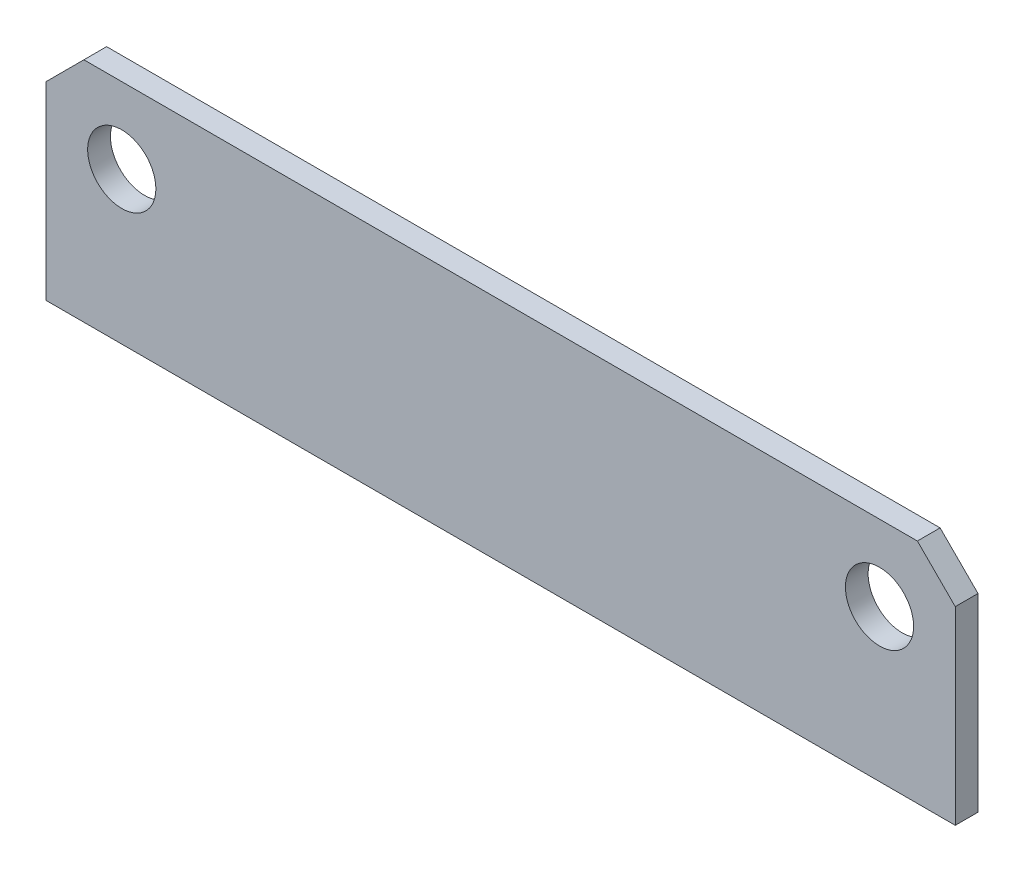
ISO-10303-21;
HEADER;
FILE_DESCRIPTION(('STEP AP214'),'2;1');
FILE_NAME('part.step','',(''),(''),'','','');
FILE_SCHEMA(('AUTOMOTIVE_DESIGN { 1 0 10303 214 1 1 1 1 }'));
ENDSEC;
DATA;
#1=APPLICATION_CONTEXT('core data for automotive mechanical design processes');
#2=APPLICATION_PROTOCOL_DEFINITION('international standard','automotive_design',2000,#1);
#3=PRODUCT_CONTEXT('',#1,'mechanical');
#4=PRODUCT('Part','Part','',(#3));
#5=PRODUCT_RELATED_PRODUCT_CATEGORY('part','',(#4));
#6=PRODUCT_DEFINITION_FORMATION('','',#4);
#7=PRODUCT_DEFINITION_CONTEXT('part definition',#1,'design');
#8=PRODUCT_DEFINITION('design','',#6,#7);
#9=PRODUCT_DEFINITION_SHAPE('','',#8);
#10=(LENGTH_UNIT() NAMED_UNIT(*) SI_UNIT(.MILLI.,.METRE.));
#11=(NAMED_UNIT(*) PLANE_ANGLE_UNIT() SI_UNIT($,.RADIAN.));
#12=(NAMED_UNIT(*) SI_UNIT($,.STERADIAN.) SOLID_ANGLE_UNIT());
#13=UNCERTAINTY_MEASURE_WITH_UNIT(LENGTH_MEASURE(1.E-05),#10,'distance_accuracy_value','');
#14=(GEOMETRIC_REPRESENTATION_CONTEXT(3) GLOBAL_UNCERTAINTY_ASSIGNED_CONTEXT((#13)) GLOBAL_UNIT_ASSIGNED_CONTEXT((#10,
#11,#12)) REPRESENTATION_CONTEXT('',''));
#15=CARTESIAN_POINT('',(0.,0.,0.));
#16=DIRECTION('',(0.,0.,1.));
#17=DIRECTION('',(1.,0.,0.));
#18=AXIS2_PLACEMENT_3D('',#15,#16,#17);
#19=CARTESIAN_POINT('',(0.,0.,3.));
#20=DIRECTION('',(0.,0.,1.));
#21=DIRECTION('',(1.,0.,0.));
#22=AXIS2_PLACEMENT_3D('',#19,#20,#21);
#23=PLANE('',#22);
#24=CARTESIAN_POINT('',(-50.,20.,3.));
#25=DIRECTION('',(0.,0.,1.));
#26=DIRECTION('',(1.,0.,0.));
#27=AXIS2_PLACEMENT_3D('',#24,#25,#26);
#28=CIRCLE('',#27,4.5);
#29=CARTESIAN_POINT('',(-45.5,20.,3.));
#30=VERTEX_POINT('',#29);
#31=EDGE_CURVE('E122',#30,#30,#28,.T.);
#32=ORIENTED_EDGE('',*,*,#31,.F.);
#33=EDGE_LOOP('',(#32));
#34=FACE_BOUND('',#33,.T.);
#35=DIRECTION('',(0.,1.,0.));
#36=VECTOR('',#35,1.);
#37=CARTESIAN_POINT('',(60.,25.,3.));
#38=LINE('',#37,#36);
#39=CARTESIAN_POINT('',(60.,0.,3.));
#40=VERTEX_POINT('',#39);
#41=CARTESIAN_POINT('',(60.,25.,3.));
#42=VERTEX_POINT('',#41);
#43=EDGE_CURVE('E129',#40,#42,#38,.T.);
#44=ORIENTED_EDGE('',*,*,#43,.T.);
#45=DIRECTION('',(-0.707106781186547,0.707106781186548,0.));
#46=VECTOR('',#45,1.);
#47=CARTESIAN_POINT('',(55.,30.,3.));
#48=LINE('',#47,#46);
#49=CARTESIAN_POINT('',(55.,30.,3.));
#50=VERTEX_POINT('',#49);
#51=EDGE_CURVE('E87',#42,#50,#48,.T.);
#52=ORIENTED_EDGE('',*,*,#51,.T.);
#53=DIRECTION('',(-1.,0.,0.));
#54=VECTOR('',#53,1.);
#55=CARTESIAN_POINT('',(-55.,30.,3.));
#56=LINE('',#55,#54);
#57=CARTESIAN_POINT('',(-55.,30.,3.));
#58=VERTEX_POINT('',#57);
#59=EDGE_CURVE('E100',#50,#58,#56,.T.);
#60=ORIENTED_EDGE('',*,*,#59,.T.);
#61=DIRECTION('',(-0.707106781186547,-0.707106781186548,0.));
#62=VECTOR('',#61,1.);
#63=CARTESIAN_POINT('',(-60.,25.,3.));
#64=LINE('',#63,#62);
#65=CARTESIAN_POINT('',(-60.,25.,3.));
#66=VERTEX_POINT('',#65);
#67=EDGE_CURVE('E94',#58,#66,#64,.T.);
#68=ORIENTED_EDGE('',*,*,#67,.T.);
#69=DIRECTION('',(0.,-1.,0.));
#70=VECTOR('',#69,1.);
#71=CARTESIAN_POINT('',(-60.,25.,3.));
#72=LINE('',#71,#70);
#73=CARTESIAN_POINT('',(-60.,0.,3.));
#74=VERTEX_POINT('',#73);
#75=EDGE_CURVE('E98',#66,#74,#72,.T.);
#76=ORIENTED_EDGE('',*,*,#75,.T.);
#77=DIRECTION('',(1.,0.,0.));
#78=VECTOR('',#77,1.);
#79=CARTESIAN_POINT('',(-60.,0.,3.));
#80=LINE('',#79,#78);
#81=EDGE_CURVE('E50',#74,#40,#80,.T.);
#82=ORIENTED_EDGE('',*,*,#81,.T.);
#83=EDGE_LOOP('',(#44,#52,#60,#68,#76,#82));
#84=FACE_BOUND('',#83,.T.);
#85=CARTESIAN_POINT('',(50.,20.,3.));
#86=DIRECTION('',(0.,0.,1.));
#87=DIRECTION('',(1.,0.,0.));
#88=AXIS2_PLACEMENT_3D('',#85,#86,#87);
#89=CIRCLE('',#88,4.5);
#90=CARTESIAN_POINT('',(54.5,20.,3.));
#91=VERTEX_POINT('',#90);
#92=EDGE_CURVE('E171',#91,#91,#89,.T.);
#93=ORIENTED_EDGE('',*,*,#92,.F.);
#94=EDGE_LOOP('',(#93));
#95=FACE_BOUND('',#94,.T.);
#96=ADVANCED_FACE('F33',(#34,#84,#95),#23,.T.);
#97=CARTESIAN_POINT('',(0.,0.,0.));
#98=DIRECTION('',(0.,0.,1.));
#99=DIRECTION('',(1.,0.,0.));
#100=AXIS2_PLACEMENT_3D('',#97,#98,#99);
#101=PLANE('',#100);
#102=DIRECTION('',(0.,1.,0.));
#103=VECTOR('',#102,1.);
#104=CARTESIAN_POINT('',(60.,25.,0.));
#105=LINE('',#104,#103);
#106=CARTESIAN_POINT('',(60.,0.,0.));
#107=VERTEX_POINT('',#106);
#108=CARTESIAN_POINT('',(60.,25.,0.));
#109=VERTEX_POINT('',#108);
#110=EDGE_CURVE('E118',#107,#109,#105,.T.);
#111=ORIENTED_EDGE('',*,*,#110,.F.);
#112=DIRECTION('',(1.,0.,0.));
#113=VECTOR('',#112,1.);
#114=CARTESIAN_POINT('',(-60.,0.,0.));
#115=LINE('',#114,#113);
#116=CARTESIAN_POINT('',(-60.,0.,0.));
#117=VERTEX_POINT('',#116);
#118=EDGE_CURVE('E79',#117,#107,#115,.T.);
#119=ORIENTED_EDGE('',*,*,#118,.F.);
#120=DIRECTION('',(0.,-1.,0.));
#121=VECTOR('',#120,1.);
#122=CARTESIAN_POINT('',(-60.,25.,0.));
#123=LINE('',#122,#121);
#124=CARTESIAN_POINT('',(-60.,25.,0.));
#125=VERTEX_POINT('',#124);
#126=EDGE_CURVE('E73',#125,#117,#123,.T.);
#127=ORIENTED_EDGE('',*,*,#126,.F.);
#128=DIRECTION('',(-0.707106781186547,-0.707106781186548,0.));
#129=VECTOR('',#128,1.);
#130=CARTESIAN_POINT('',(-60.,25.,0.));
#131=LINE('',#130,#129);
#132=CARTESIAN_POINT('',(-55.,30.,0.));
#133=VERTEX_POINT('',#132);
#134=EDGE_CURVE('E108',#133,#125,#131,.T.);
#135=ORIENTED_EDGE('',*,*,#134,.F.);
#136=DIRECTION('',(-1.,0.,0.));
#137=VECTOR('',#136,1.);
#138=CARTESIAN_POINT('',(-55.,30.,0.));
#139=LINE('',#138,#137);
#140=CARTESIAN_POINT('',(55.,30.,0.));
#141=VERTEX_POINT('',#140);
#142=EDGE_CURVE('E124',#141,#133,#139,.T.);
#143=ORIENTED_EDGE('',*,*,#142,.F.);
#144=DIRECTION('',(-0.707106781186547,0.707106781186548,0.));
#145=VECTOR('',#144,1.);
#146=CARTESIAN_POINT('',(55.,30.,0.));
#147=LINE('',#146,#145);
#148=EDGE_CURVE('E121',#109,#141,#147,.T.);
#149=ORIENTED_EDGE('',*,*,#148,.F.);
#150=EDGE_LOOP('',(#111,#119,#127,#135,#143,#149));
#151=FACE_BOUND('',#150,.T.);
#152=CARTESIAN_POINT('',(-50.,20.,0.));
#153=DIRECTION('',(0.,0.,1.));
#154=DIRECTION('',(1.,0.,0.));
#155=AXIS2_PLACEMENT_3D('',#152,#153,#154);
#156=CIRCLE('',#155,4.5);
#157=CARTESIAN_POINT('',(-45.5,20.,0.));
#158=VERTEX_POINT('',#157);
#159=EDGE_CURVE('E177',#158,#158,#156,.T.);
#160=ORIENTED_EDGE('',*,*,#159,.T.);
#161=EDGE_LOOP('',(#160));
#162=FACE_BOUND('',#161,.T.);
#163=CARTESIAN_POINT('',(50.,20.,0.));
#164=DIRECTION('',(0.,0.,1.));
#165=DIRECTION('',(1.,0.,0.));
#166=AXIS2_PLACEMENT_3D('',#163,#164,#165);
#167=CIRCLE('',#166,4.5);
#168=CARTESIAN_POINT('',(54.5,20.,0.));
#169=VERTEX_POINT('',#168);
#170=EDGE_CURVE('E174',#169,#169,#167,.T.);
#171=ORIENTED_EDGE('',*,*,#170,.T.);
#172=EDGE_LOOP('',(#171));
#173=FACE_BOUND('',#172,.T.);
#174=ADVANCED_FACE('F138',(#151,#162,#173),#101,.F.);
#175=CARTESIAN_POINT('',(60.,25.,3.));
#176=DIRECTION('',(-1.,0.,0.));
#177=DIRECTION('',(0.,-1.,0.));
#178=AXIS2_PLACEMENT_3D('',#175,#176,#177);
#179=PLANE('',#178);
#180=ORIENTED_EDGE('',*,*,#110,.T.);
#181=DIRECTION('',(0.,0.,-1.));
#182=VECTOR('',#181,1.);
#183=CARTESIAN_POINT('',(60.,25.,3.));
#184=LINE('',#183,#182);
#185=EDGE_CURVE('E11',#42,#109,#184,.T.);
#186=ORIENTED_EDGE('',*,*,#185,.F.);
#187=ORIENTED_EDGE('',*,*,#43,.F.);
#188=DIRECTION('',(0.,0.,-1.));
#189=VECTOR('',#188,1.);
#190=CARTESIAN_POINT('',(60.,0.,3.));
#191=LINE('',#190,#189);
#192=EDGE_CURVE('E114',#40,#107,#191,.T.);
#193=ORIENTED_EDGE('',*,*,#192,.T.);
#194=EDGE_LOOP('',(#180,#186,#187,#193));
#195=FACE_BOUND('',#194,.T.);
#196=ADVANCED_FACE('F35',(#195),#179,.F.);
#197=CARTESIAN_POINT('',(55.,30.,3.));
#198=DIRECTION('',(-0.707106781186548,-0.707106781186547,0.));
#199=DIRECTION('',(0.707106781186547,-0.707106781186548,0.));
#200=AXIS2_PLACEMENT_3D('',#197,#198,#199);
#201=PLANE('',#200);
#202=ORIENTED_EDGE('',*,*,#148,.T.);
#203=DIRECTION('',(0.,0.,-1.));
#204=VECTOR('',#203,1.);
#205=CARTESIAN_POINT('',(55.,30.,3.));
#206=LINE('',#205,#204);
#207=EDGE_CURVE('E42',#50,#141,#206,.T.);
#208=ORIENTED_EDGE('',*,*,#207,.F.);
#209=ORIENTED_EDGE('',*,*,#51,.F.);
#210=ORIENTED_EDGE('',*,*,#185,.T.);
#211=EDGE_LOOP('',(#202,#208,#209,#210));
#212=FACE_BOUND('',#211,.T.);
#213=ADVANCED_FACE('F218',(#212),#201,.F.);
#214=CARTESIAN_POINT('',(-55.,30.,3.));
#215=DIRECTION('',(0.,-1.,0.));
#216=DIRECTION('',(0.,0.,-1.));
#217=AXIS2_PLACEMENT_3D('',#214,#215,#216);
#218=PLANE('',#217);
#219=ORIENTED_EDGE('',*,*,#142,.T.);
#220=DIRECTION('',(0.,0.,-1.));
#221=VECTOR('',#220,1.);
#222=CARTESIAN_POINT('',(-55.,30.,3.));
#223=LINE('',#222,#221);
#224=EDGE_CURVE('E109',#58,#133,#223,.T.);
#225=ORIENTED_EDGE('',*,*,#224,.F.);
#226=ORIENTED_EDGE('',*,*,#59,.F.);
#227=ORIENTED_EDGE('',*,*,#207,.T.);
#228=EDGE_LOOP('',(#219,#225,#226,#227));
#229=FACE_BOUND('',#228,.T.);
#230=ADVANCED_FACE('F135',(#229),#218,.F.);
#231=CARTESIAN_POINT('',(-60.,25.,3.));
#232=DIRECTION('',(0.707106781186548,-0.707106781186547,0.));
#233=DIRECTION('',(0.707106781186547,0.707106781186548,0.));
#234=AXIS2_PLACEMENT_3D('',#231,#232,#233);
#235=PLANE('',#234);
#236=ORIENTED_EDGE('',*,*,#134,.T.);
#237=DIRECTION('',(0.,0.,-1.));
#238=VECTOR('',#237,1.);
#239=CARTESIAN_POINT('',(-60.,25.,3.));
#240=LINE('',#239,#238);
#241=EDGE_CURVE('E105',#66,#125,#240,.T.);
#242=ORIENTED_EDGE('',*,*,#241,.F.);
#243=ORIENTED_EDGE('',*,*,#67,.F.);
#244=ORIENTED_EDGE('',*,*,#224,.T.);
#245=EDGE_LOOP('',(#236,#242,#243,#244));
#246=FACE_BOUND('',#245,.T.);
#247=ADVANCED_FACE('F106',(#246),#235,.F.);
#248=CARTESIAN_POINT('',(-60.,25.,3.));
#249=DIRECTION('',(1.,0.,0.));
#250=DIRECTION('',(0.,1.,0.));
#251=AXIS2_PLACEMENT_3D('',#248,#249,#250);
#252=PLANE('',#251);
#253=ORIENTED_EDGE('',*,*,#126,.T.);
#254=DIRECTION('',(0.,0.,-1.));
#255=VECTOR('',#254,1.);
#256=CARTESIAN_POINT('',(-60.,0.,3.));
#257=LINE('',#256,#255);
#258=EDGE_CURVE('E110',#74,#117,#257,.T.);
#259=ORIENTED_EDGE('',*,*,#258,.F.);
#260=ORIENTED_EDGE('',*,*,#75,.F.);
#261=ORIENTED_EDGE('',*,*,#241,.T.);
#262=EDGE_LOOP('',(#253,#259,#260,#261));
#263=FACE_BOUND('',#262,.T.);
#264=ADVANCED_FACE('F112',(#263),#252,.F.);
#265=CARTESIAN_POINT('',(-60.,0.,3.));
#266=DIRECTION('',(0.,1.,0.));
#267=DIRECTION('',(0.,0.,1.));
#268=AXIS2_PLACEMENT_3D('',#265,#266,#267);
#269=PLANE('',#268);
#270=ORIENTED_EDGE('',*,*,#118,.T.);
#271=ORIENTED_EDGE('',*,*,#192,.F.);
#272=ORIENTED_EDGE('',*,*,#81,.F.);
#273=ORIENTED_EDGE('',*,*,#258,.T.);
#274=EDGE_LOOP('',(#270,#271,#272,#273));
#275=FACE_BOUND('',#274,.T.);
#276=ADVANCED_FACE('F143',(#275),#269,.F.);
#277=CARTESIAN_POINT('',(-50.,20.,3.));
#278=DIRECTION('',(0.,0.,-1.));
#279=DIRECTION('',(-1.,0.,0.));
#280=AXIS2_PLACEMENT_3D('',#277,#278,#279);
#281=CYLINDRICAL_SURFACE('',#280,4.5);
#282=ORIENTED_EDGE('',*,*,#31,.T.);
#283=EDGE_LOOP('',(#282));
#284=FACE_BOUND('',#283,.T.);
#285=ORIENTED_EDGE('',*,*,#159,.F.);
#286=EDGE_LOOP('',(#285));
#287=FACE_BOUND('',#286,.T.);
#288=ADVANCED_FACE('F145',(#284,#287),#281,.F.);
#289=CARTESIAN_POINT('',(50.,20.,3.));
#290=DIRECTION('',(0.,0.,-1.));
#291=DIRECTION('',(-1.,0.,0.));
#292=AXIS2_PLACEMENT_3D('',#289,#290,#291);
#293=CYLINDRICAL_SURFACE('',#292,4.5);
#294=ORIENTED_EDGE('',*,*,#92,.T.);
#295=EDGE_LOOP('',(#294));
#296=FACE_BOUND('',#295,.T.);
#297=ORIENTED_EDGE('',*,*,#170,.F.);
#298=EDGE_LOOP('',(#297));
#299=FACE_BOUND('',#298,.T.);
#300=ADVANCED_FACE('F151',(#296,#299),#293,.F.);
#301=CLOSED_SHELL('',(#96,#174,#196,#213,#230,#247,#264,#276,#288,#300));
#302=MANIFOLD_SOLID_BREP('B2',#301);
#303=ADVANCED_BREP_SHAPE_REPRESENTATION('',(#18,#302),#14);
#304=SHAPE_DEFINITION_REPRESENTATION(#9,#303);
ENDSEC;
END-ISO-10303-21;
